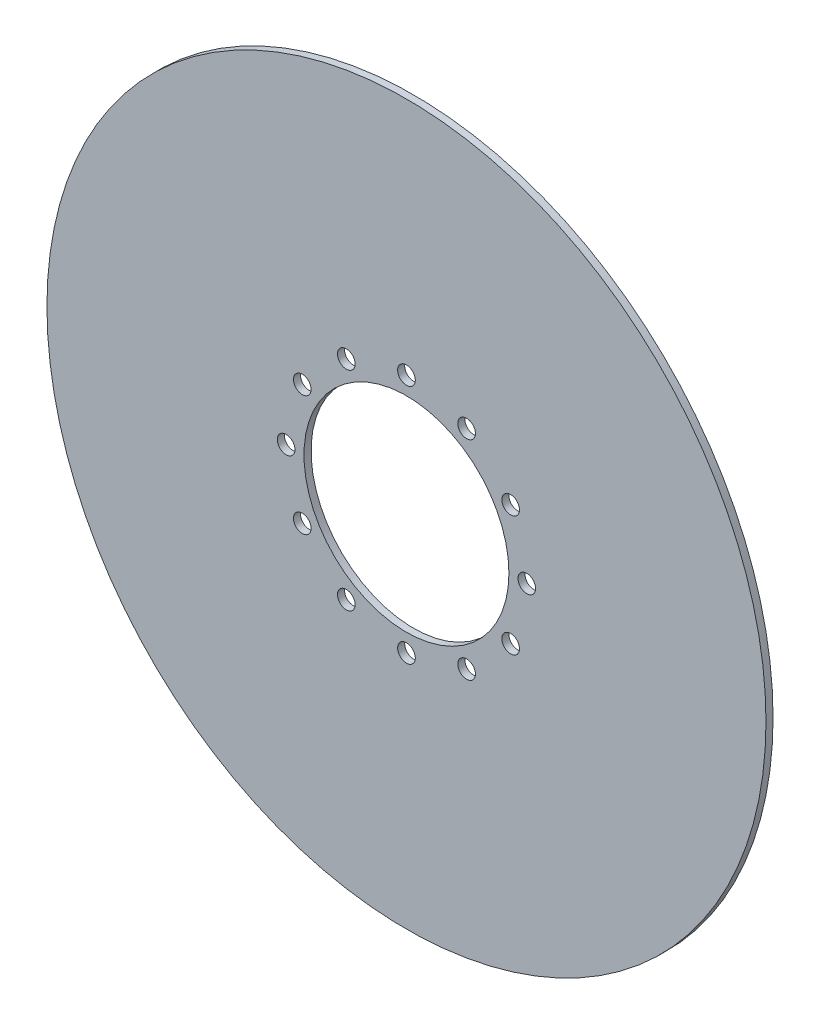
ISO-10303-21;
HEADER;
FILE_DESCRIPTION(('STEP AP214'),'2;1');
FILE_NAME('part.step','',(''),(''),'','','');
FILE_SCHEMA(('AUTOMOTIVE_DESIGN { 1 0 10303 214 1 1 1 1 }'));
ENDSEC;
DATA;
#1=APPLICATION_CONTEXT('core data for automotive mechanical design processes');
#2=APPLICATION_PROTOCOL_DEFINITION('international standard','automotive_design',2000,#1);
#3=PRODUCT_CONTEXT('',#1,'mechanical');
#4=PRODUCT('Part','Part','',(#3));
#5=PRODUCT_RELATED_PRODUCT_CATEGORY('part','',(#4));
#6=PRODUCT_DEFINITION_FORMATION('','',#4);
#7=PRODUCT_DEFINITION_CONTEXT('part definition',#1,'design');
#8=PRODUCT_DEFINITION('design','',#6,#7);
#9=PRODUCT_DEFINITION_SHAPE('','',#8);
#10=(LENGTH_UNIT() NAMED_UNIT(*) SI_UNIT(.MILLI.,.METRE.));
#11=(NAMED_UNIT(*) PLANE_ANGLE_UNIT() SI_UNIT($,.RADIAN.));
#12=(NAMED_UNIT(*) SI_UNIT($,.STERADIAN.) SOLID_ANGLE_UNIT());
#13=UNCERTAINTY_MEASURE_WITH_UNIT(LENGTH_MEASURE(1.E-05),#10,'distance_accuracy_value','');
#14=(GEOMETRIC_REPRESENTATION_CONTEXT(3) GLOBAL_UNCERTAINTY_ASSIGNED_CONTEXT((#13)) GLOBAL_UNIT_ASSIGNED_CONTEXT((#10,
#11,#12)) REPRESENTATION_CONTEXT('',''));
#15=CARTESIAN_POINT('',(0.,0.,0.));
#16=DIRECTION('',(0.,0.,1.));
#17=DIRECTION('',(1.,0.,0.));
#18=AXIS2_PLACEMENT_3D('',#15,#16,#17);
#19=CARTESIAN_POINT('',(0.,0.,2.));
#20=DIRECTION('',(0.,0.,1.));
#21=DIRECTION('',(1.,0.,0.));
#22=AXIS2_PLACEMENT_3D('',#19,#20,#21);
#23=PLANE('',#22);
#24=CARTESIAN_POINT('',(-29.4448637286702,16.9999999999987,2.));
#25=DIRECTION('',(0.,0.,1.));
#26=DIRECTION('',(1.,0.,0.));
#27=AXIS2_PLACEMENT_3D('',#24,#25,#26);
#28=CIRCLE('',#27,2.49698906987796);
#29=CARTESIAN_POINT('',(-26.9478746587923,16.9999999999987,2.));
#30=VERTEX_POINT('',#29);
#31=EDGE_CURVE('E108',#30,#30,#28,.T.);
#32=ORIENTED_EDGE('',*,*,#31,.F.);
#33=EDGE_LOOP('',(#32));
#34=FACE_BOUND('',#33,.T.);
#35=CARTESIAN_POINT('',(-29.4448637286688,-17.0000000000013,2.));
#36=DIRECTION('',(0.,0.,1.));
#37=DIRECTION('',(1.,0.,0.));
#38=AXIS2_PLACEMENT_3D('',#35,#36,#37);
#39=CIRCLE('',#38,2.49698906987796);
#40=CARTESIAN_POINT('',(-26.9478746587908,-17.0000000000013,2.));
#41=VERTEX_POINT('',#40);
#42=EDGE_CURVE('E96',#41,#41,#39,.T.);
#43=ORIENTED_EDGE('',*,*,#42,.F.);
#44=EDGE_LOOP('',(#43));
#45=FACE_BOUND('',#44,.T.);
#46=CARTESIAN_POINT('',(2.86804195578331E-12,-34.,2.));
#47=DIRECTION('',(0.,0.,1.));
#48=DIRECTION('',(1.,0.,0.));
#49=AXIS2_PLACEMENT_3D('',#46,#47,#48);
#50=CIRCLE('',#49,2.49698906987796);
#51=CARTESIAN_POINT('',(2.49698906988083,-34.,2.));
#52=VERTEX_POINT('',#51);
#53=EDGE_CURVE('E84',#52,#52,#50,.T.);
#54=ORIENTED_EDGE('',*,*,#53,.F.);
#55=EDGE_LOOP('',(#54));
#56=FACE_BOUND('',#55,.T.);
#57=CARTESIAN_POINT('',(29.4448637286731,-16.9999999999988,2.));
#58=DIRECTION('',(0.,0.,1.));
#59=DIRECTION('',(1.,0.,0.));
#60=AXIS2_PLACEMENT_3D('',#57,#58,#59);
#61=CIRCLE('',#60,2.49698906987769);
#62=CARTESIAN_POINT('',(31.9418527985508,-16.9999999999988,2.));
#63=VERTEX_POINT('',#62);
#64=EDGE_CURVE('E72',#63,#63,#61,.T.);
#65=ORIENTED_EDGE('',*,*,#64,.F.);
#66=EDGE_LOOP('',(#65));
#67=FACE_BOUND('',#66,.T.);
#68=CARTESIAN_POINT('',(29.4448637286716,17.0000000000012,2.));
#69=DIRECTION('',(0.,0.,1.));
#70=DIRECTION('',(1.,0.,0.));
#71=AXIS2_PLACEMENT_3D('',#68,#69,#70);
#72=CIRCLE('',#71,2.49698906987796);
#73=CARTESIAN_POINT('',(31.9418527985496,17.0000000000012,2.));
#74=VERTEX_POINT('',#73);
#75=EDGE_CURVE('E60',#74,#74,#72,.T.);
#76=ORIENTED_EDGE('',*,*,#75,.F.);
#77=EDGE_LOOP('',(#76));
#78=FACE_BOUND('',#77,.T.);
#79=CARTESIAN_POINT('',(0.,34.,2.));
#80=DIRECTION('',(0.,0.,1.));
#81=DIRECTION('',(1.,0.,0.));
#82=AXIS2_PLACEMENT_3D('',#79,#80,#81);
#83=CIRCLE('',#82,2.49698906987796);
#84=CARTESIAN_POINT('',(2.49698906987796,34.,2.));
#85=VERTEX_POINT('',#84);
#86=EDGE_CURVE('E48',#85,#85,#83,.T.);
#87=ORIENTED_EDGE('',*,*,#86,.F.);
#88=EDGE_LOOP('',(#87));
#89=FACE_BOUND('',#88,.T.);
#90=CARTESIAN_POINT('',(0.,0.,2.));
#91=DIRECTION('',(0.,0.,1.));
#92=DIRECTION('',(1.,0.,0.));
#93=AXIS2_PLACEMENT_3D('',#90,#91,#92);
#94=CIRCLE('',#93,101.6);
#95=CARTESIAN_POINT('',(101.6,0.,2.));
#96=VERTEX_POINT('',#95);
#97=EDGE_CURVE('E10',#96,#96,#94,.T.);
#98=ORIENTED_EDGE('',*,*,#97,.T.);
#99=EDGE_LOOP('',(#98));
#100=FACE_BOUND('',#99,.T.);
#101=CARTESIAN_POINT('',(0.,0.,2.));
#102=DIRECTION('',(0.,0.,1.));
#103=DIRECTION('',(1.,0.,0.));
#104=AXIS2_PLACEMENT_3D('',#101,#102,#103);
#105=CIRCLE('',#104,28.956);
#106=CARTESIAN_POINT('',(28.956,0.,2.));
#107=VERTEX_POINT('',#106);
#108=EDGE_CURVE('E43',#107,#107,#105,.T.);
#109=ORIENTED_EDGE('',*,*,#108,.F.);
#110=EDGE_LOOP('',(#109));
#111=FACE_BOUND('',#110,.T.);
#112=CARTESIAN_POINT('',(17.0000000000002,29.4448637286716,2.));
#113=DIRECTION('',(0.,0.,1.));
#114=DIRECTION('',(1.,0.,0.));
#115=AXIS2_PLACEMENT_3D('',#112,#113,#114);
#116=CIRCLE('',#115,2.49698906987796);
#117=CARTESIAN_POINT('',(19.4969890698782,29.4448637286716,2.));
#118=VERTEX_POINT('',#117);
#119=EDGE_CURVE('E54',#118,#118,#116,.T.);
#120=ORIENTED_EDGE('',*,*,#119,.F.);
#121=EDGE_LOOP('',(#120));
#122=FACE_BOUND('',#121,.T.);
#123=CARTESIAN_POINT('',(34.0000000000014,1.43402097789165E-12,2.));
#124=DIRECTION('',(0.,0.,1.));
#125=DIRECTION('',(1.,0.,0.));
#126=AXIS2_PLACEMENT_3D('',#123,#124,#125);
#127=CIRCLE('',#126,2.49698906987796);
#128=CARTESIAN_POINT('',(36.4969890698794,1.43402097789165E-12,2.));
#129=VERTEX_POINT('',#128);
#130=EDGE_CURVE('E66',#129,#129,#127,.T.);
#131=ORIENTED_EDGE('',*,*,#130,.F.);
#132=EDGE_LOOP('',(#131));
#133=FACE_BOUND('',#132,.T.);
#134=CARTESIAN_POINT('',(17.0000000000027,-29.4448637286702,2.));
#135=DIRECTION('',(0.,0.,1.));
#136=DIRECTION('',(1.,0.,0.));
#137=AXIS2_PLACEMENT_3D('',#134,#135,#136);
#138=CIRCLE('',#137,2.49698906987837);
#139=CARTESIAN_POINT('',(19.4969890698811,-29.4448637286702,2.));
#140=VERTEX_POINT('',#139);
#141=EDGE_CURVE('E78',#140,#140,#138,.T.);
#142=ORIENTED_EDGE('',*,*,#141,.F.);
#143=EDGE_LOOP('',(#142));
#144=FACE_BOUND('',#143,.T.);
#145=CARTESIAN_POINT('',(-16.9999999999973,-29.4448637286716,2.));
#146=DIRECTION('',(0.,0.,1.));
#147=DIRECTION('',(1.,0.,0.));
#148=AXIS2_PLACEMENT_3D('',#145,#146,#147);
#149=CIRCLE('',#148,2.49698906987796);
#150=CARTESIAN_POINT('',(-14.5030109301194,-29.4448637286716,2.));
#151=VERTEX_POINT('',#150);
#152=EDGE_CURVE('E90',#151,#151,#149,.T.);
#153=ORIENTED_EDGE('',*,*,#152,.F.);
#154=EDGE_LOOP('',(#153));
#155=FACE_BOUND('',#154,.T.);
#156=CARTESIAN_POINT('',(-33.9999999999986,-1.43818477700875E-12,2.));
#157=DIRECTION('',(0.,0.,1.));
#158=DIRECTION('',(1.,0.,0.));
#159=AXIS2_PLACEMENT_3D('',#156,#157,#158);
#160=CIRCLE('',#159,2.49698906987796);
#161=CARTESIAN_POINT('',(-31.5030109301206,-1.43818477700875E-12,2.));
#162=VERTEX_POINT('',#161);
#163=EDGE_CURVE('E102',#162,#162,#160,.T.);
#164=ORIENTED_EDGE('',*,*,#163,.F.);
#165=EDGE_LOOP('',(#164));
#166=FACE_BOUND('',#165,.T.);
#167=CARTESIAN_POINT('',(-16.9999999999998,29.4448637286702,2.));
#168=DIRECTION('',(0.,0.,1.));
#169=DIRECTION('',(1.,0.,0.));
#170=AXIS2_PLACEMENT_3D('',#167,#168,#169);
#171=CIRCLE('',#170,2.49698906987796);
#172=CARTESIAN_POINT('',(-14.5030109301219,29.4448637286702,2.));
#173=VERTEX_POINT('',#172);
#174=EDGE_CURVE('E114',#173,#173,#171,.T.);
#175=ORIENTED_EDGE('',*,*,#174,.F.);
#176=EDGE_LOOP('',(#175));
#177=FACE_BOUND('',#176,.T.);
#178=ADVANCED_FACE('F32',(#34,#45,#56,#67,#78,#89,#100,#111,#122,#133,#144,#155,#166,#177),#23,.T.);
#179=CARTESIAN_POINT('',(0.,0.,0.));
#180=DIRECTION('',(0.,0.,1.));
#181=DIRECTION('',(1.,0.,0.));
#182=AXIS2_PLACEMENT_3D('',#179,#180,#181);
#183=PLANE('',#182);
#184=CARTESIAN_POINT('',(0.,0.,0.));
#185=DIRECTION('',(0.,0.,1.));
#186=DIRECTION('',(1.,0.,0.));
#187=AXIS2_PLACEMENT_3D('',#184,#185,#186);
#188=CIRCLE('',#187,101.6);
#189=CARTESIAN_POINT('',(101.6,0.,0.));
#190=VERTEX_POINT('',#189);
#191=EDGE_CURVE('E36',#190,#190,#188,.T.);
#192=ORIENTED_EDGE('',*,*,#191,.F.);
#193=EDGE_LOOP('',(#192));
#194=FACE_BOUND('',#193,.T.);
#195=CARTESIAN_POINT('',(0.,0.,0.));
#196=DIRECTION('',(0.,0.,1.));
#197=DIRECTION('',(1.,0.,0.));
#198=AXIS2_PLACEMENT_3D('',#195,#196,#197);
#199=CIRCLE('',#198,28.956);
#200=CARTESIAN_POINT('',(28.956,0.,0.));
#201=VERTEX_POINT('',#200);
#202=EDGE_CURVE('E45',#201,#201,#199,.T.);
#203=ORIENTED_EDGE('',*,*,#202,.T.);
#204=EDGE_LOOP('',(#203));
#205=FACE_BOUND('',#204,.T.);
#206=CARTESIAN_POINT('',(0.,34.,0.));
#207=DIRECTION('',(0.,0.,1.));
#208=DIRECTION('',(1.,0.,0.));
#209=AXIS2_PLACEMENT_3D('',#206,#207,#208);
#210=CIRCLE('',#209,2.49698906987796);
#211=CARTESIAN_POINT('',(2.49698906987796,34.,0.));
#212=VERTEX_POINT('',#211);
#213=EDGE_CURVE('E51',#212,#212,#210,.T.);
#214=ORIENTED_EDGE('',*,*,#213,.T.);
#215=EDGE_LOOP('',(#214));
#216=FACE_BOUND('',#215,.T.);
#217=CARTESIAN_POINT('',(17.0000000000002,29.4448637286716,0.));
#218=DIRECTION('',(0.,0.,1.));
#219=DIRECTION('',(1.,0.,0.));
#220=AXIS2_PLACEMENT_3D('',#217,#218,#219);
#221=CIRCLE('',#220,2.49698906987796);
#222=CARTESIAN_POINT('',(19.4969890698782,29.4448637286716,0.));
#223=VERTEX_POINT('',#222);
#224=EDGE_CURVE('E57',#223,#223,#221,.T.);
#225=ORIENTED_EDGE('',*,*,#224,.T.);
#226=EDGE_LOOP('',(#225));
#227=FACE_BOUND('',#226,.T.);
#228=CARTESIAN_POINT('',(29.4448637286716,17.0000000000012,0.));
#229=DIRECTION('',(0.,0.,1.));
#230=DIRECTION('',(1.,0.,0.));
#231=AXIS2_PLACEMENT_3D('',#228,#229,#230);
#232=CIRCLE('',#231,2.49698906987796);
#233=CARTESIAN_POINT('',(31.9418527985496,17.0000000000012,0.));
#234=VERTEX_POINT('',#233);
#235=EDGE_CURVE('E63',#234,#234,#232,.T.);
#236=ORIENTED_EDGE('',*,*,#235,.T.);
#237=EDGE_LOOP('',(#236));
#238=FACE_BOUND('',#237,.T.);
#239=CARTESIAN_POINT('',(34.0000000000014,1.43402097789165E-12,0.));
#240=DIRECTION('',(0.,0.,1.));
#241=DIRECTION('',(1.,0.,0.));
#242=AXIS2_PLACEMENT_3D('',#239,#240,#241);
#243=CIRCLE('',#242,2.49698906987796);
#244=CARTESIAN_POINT('',(36.4969890698794,1.43402097789165E-12,0.));
#245=VERTEX_POINT('',#244);
#246=EDGE_CURVE('E69',#245,#245,#243,.T.);
#247=ORIENTED_EDGE('',*,*,#246,.T.);
#248=EDGE_LOOP('',(#247));
#249=FACE_BOUND('',#248,.T.);
#250=CARTESIAN_POINT('',(29.4448637286731,-16.9999999999988,0.));
#251=DIRECTION('',(0.,0.,1.));
#252=DIRECTION('',(1.,0.,0.));
#253=AXIS2_PLACEMENT_3D('',#250,#251,#252);
#254=CIRCLE('',#253,2.49698906987769);
#255=CARTESIAN_POINT('',(31.9418527985508,-16.9999999999988,0.));
#256=VERTEX_POINT('',#255);
#257=EDGE_CURVE('E75',#256,#256,#254,.T.);
#258=ORIENTED_EDGE('',*,*,#257,.T.);
#259=EDGE_LOOP('',(#258));
#260=FACE_BOUND('',#259,.T.);
#261=CARTESIAN_POINT('',(17.0000000000027,-29.4448637286702,0.));
#262=DIRECTION('',(0.,0.,1.));
#263=DIRECTION('',(1.,0.,0.));
#264=AXIS2_PLACEMENT_3D('',#261,#262,#263);
#265=CIRCLE('',#264,2.49698906987837);
#266=CARTESIAN_POINT('',(19.4969890698811,-29.4448637286702,0.));
#267=VERTEX_POINT('',#266);
#268=EDGE_CURVE('E81',#267,#267,#265,.T.);
#269=ORIENTED_EDGE('',*,*,#268,.T.);
#270=EDGE_LOOP('',(#269));
#271=FACE_BOUND('',#270,.T.);
#272=CARTESIAN_POINT('',(2.86804195578331E-12,-34.,0.));
#273=DIRECTION('',(0.,0.,1.));
#274=DIRECTION('',(1.,0.,0.));
#275=AXIS2_PLACEMENT_3D('',#272,#273,#274);
#276=CIRCLE('',#275,2.49698906987796);
#277=CARTESIAN_POINT('',(2.49698906988083,-34.,0.));
#278=VERTEX_POINT('',#277);
#279=EDGE_CURVE('E87',#278,#278,#276,.T.);
#280=ORIENTED_EDGE('',*,*,#279,.T.);
#281=EDGE_LOOP('',(#280));
#282=FACE_BOUND('',#281,.T.);
#283=CARTESIAN_POINT('',(-16.9999999999973,-29.4448637286716,0.));
#284=DIRECTION('',(0.,0.,1.));
#285=DIRECTION('',(1.,0.,0.));
#286=AXIS2_PLACEMENT_3D('',#283,#284,#285);
#287=CIRCLE('',#286,2.49698906987796);
#288=CARTESIAN_POINT('',(-14.5030109301194,-29.4448637286716,0.));
#289=VERTEX_POINT('',#288);
#290=EDGE_CURVE('E93',#289,#289,#287,.T.);
#291=ORIENTED_EDGE('',*,*,#290,.T.);
#292=EDGE_LOOP('',(#291));
#293=FACE_BOUND('',#292,.T.);
#294=CARTESIAN_POINT('',(-29.4448637286688,-17.0000000000013,0.));
#295=DIRECTION('',(0.,0.,1.));
#296=DIRECTION('',(1.,0.,0.));
#297=AXIS2_PLACEMENT_3D('',#294,#295,#296);
#298=CIRCLE('',#297,2.49698906987796);
#299=CARTESIAN_POINT('',(-26.9478746587908,-17.0000000000013,0.));
#300=VERTEX_POINT('',#299);
#301=EDGE_CURVE('E99',#300,#300,#298,.T.);
#302=ORIENTED_EDGE('',*,*,#301,.T.);
#303=EDGE_LOOP('',(#302));
#304=FACE_BOUND('',#303,.T.);
#305=CARTESIAN_POINT('',(-33.9999999999986,-1.43818477700875E-12,0.));
#306=DIRECTION('',(0.,0.,1.));
#307=DIRECTION('',(1.,0.,0.));
#308=AXIS2_PLACEMENT_3D('',#305,#306,#307);
#309=CIRCLE('',#308,2.49698906987796);
#310=CARTESIAN_POINT('',(-31.5030109301206,-1.43818477700875E-12,0.));
#311=VERTEX_POINT('',#310);
#312=EDGE_CURVE('E105',#311,#311,#309,.T.);
#313=ORIENTED_EDGE('',*,*,#312,.T.);
#314=EDGE_LOOP('',(#313));
#315=FACE_BOUND('',#314,.T.);
#316=CARTESIAN_POINT('',(-29.4448637286702,16.9999999999987,0.));
#317=DIRECTION('',(0.,0.,1.));
#318=DIRECTION('',(1.,0.,0.));
#319=AXIS2_PLACEMENT_3D('',#316,#317,#318);
#320=CIRCLE('',#319,2.49698906987796);
#321=CARTESIAN_POINT('',(-26.9478746587923,16.9999999999987,0.));
#322=VERTEX_POINT('',#321);
#323=EDGE_CURVE('E111',#322,#322,#320,.T.);
#324=ORIENTED_EDGE('',*,*,#323,.T.);
#325=EDGE_LOOP('',(#324));
#326=FACE_BOUND('',#325,.T.);
#327=CARTESIAN_POINT('',(-16.9999999999998,29.4448637286702,0.));
#328=DIRECTION('',(0.,0.,1.));
#329=DIRECTION('',(1.,0.,0.));
#330=AXIS2_PLACEMENT_3D('',#327,#328,#329);
#331=CIRCLE('',#330,2.49698906987796);
#332=CARTESIAN_POINT('',(-14.5030109301219,29.4448637286702,0.));
#333=VERTEX_POINT('',#332);
#334=EDGE_CURVE('E117',#333,#333,#331,.T.);
#335=ORIENTED_EDGE('',*,*,#334,.T.);
#336=EDGE_LOOP('',(#335));
#337=FACE_BOUND('',#336,.T.);
#338=ADVANCED_FACE('F127',(#194,#205,#216,#227,#238,#249,#260,#271,#282,#293,#304,#315,#326,
#337),#183,.F.);
#339=CARTESIAN_POINT('',(0.,0.,2.));
#340=DIRECTION('',(0.,0.,-1.));
#341=DIRECTION('',(-1.,0.,0.));
#342=AXIS2_PLACEMENT_3D('',#339,#340,#341);
#343=CYLINDRICAL_SURFACE('',#342,101.6);
#344=ORIENTED_EDGE('',*,*,#97,.F.);
#345=EDGE_LOOP('',(#344));
#346=FACE_BOUND('',#345,.T.);
#347=ORIENTED_EDGE('',*,*,#191,.T.);
#348=EDGE_LOOP('',(#347));
#349=FACE_BOUND('',#348,.T.);
#350=ADVANCED_FACE('F34',(#346,#349),#343,.T.);
#351=CARTESIAN_POINT('',(0.,0.,2.));
#352=DIRECTION('',(0.,0.,-1.));
#353=DIRECTION('',(-1.,0.,0.));
#354=AXIS2_PLACEMENT_3D('',#351,#352,#353);
#355=CYLINDRICAL_SURFACE('',#354,28.956);
#356=ORIENTED_EDGE('',*,*,#108,.T.);
#357=EDGE_LOOP('',(#356));
#358=FACE_BOUND('',#357,.T.);
#359=ORIENTED_EDGE('',*,*,#202,.F.);
#360=EDGE_LOOP('',(#359));
#361=FACE_BOUND('',#360,.T.);
#362=ADVANCED_FACE('F137',(#358,#361),#355,.F.);
#363=CARTESIAN_POINT('',(0.,34.,2.));
#364=DIRECTION('',(0.,0.,-1.));
#365=DIRECTION('',(-1.,0.,0.));
#366=AXIS2_PLACEMENT_3D('',#363,#364,#365);
#367=CYLINDRICAL_SURFACE('',#366,2.49698906987796);
#368=ORIENTED_EDGE('',*,*,#86,.T.);
#369=EDGE_LOOP('',(#368));
#370=FACE_BOUND('',#369,.T.);
#371=ORIENTED_EDGE('',*,*,#213,.F.);
#372=EDGE_LOOP('',(#371));
#373=FACE_BOUND('',#372,.T.);
#374=ADVANCED_FACE('F140',(#370,#373),#367,.F.);
#375=CARTESIAN_POINT('',(17.0000000000002,29.4448637286716,2.));
#376=DIRECTION('',(0.,0.,-1.));
#377=DIRECTION('',(-1.,0.,0.));
#378=AXIS2_PLACEMENT_3D('',#375,#376,#377);
#379=CYLINDRICAL_SURFACE('',#378,2.49698906987796);
#380=ORIENTED_EDGE('',*,*,#119,.T.);
#381=EDGE_LOOP('',(#380));
#382=FACE_BOUND('',#381,.T.);
#383=ORIENTED_EDGE('',*,*,#224,.F.);
#384=EDGE_LOOP('',(#383));
#385=FACE_BOUND('',#384,.T.);
#386=ADVANCED_FACE('F144',(#382,#385),#379,.F.);
#387=CARTESIAN_POINT('',(29.4448637286716,17.0000000000012,2.));
#388=DIRECTION('',(0.,0.,-1.));
#389=DIRECTION('',(-1.,0.,0.));
#390=AXIS2_PLACEMENT_3D('',#387,#388,#389);
#391=CYLINDRICAL_SURFACE('',#390,2.49698906987796);
#392=ORIENTED_EDGE('',*,*,#75,.T.);
#393=EDGE_LOOP('',(#392));
#394=FACE_BOUND('',#393,.T.);
#395=ORIENTED_EDGE('',*,*,#235,.F.);
#396=EDGE_LOOP('',(#395));
#397=FACE_BOUND('',#396,.T.);
#398=ADVANCED_FACE('F148',(#394,#397),#391,.F.);
#399=CARTESIAN_POINT('',(34.0000000000014,1.43402097789165E-12,2.));
#400=DIRECTION('',(0.,0.,-1.));
#401=DIRECTION('',(-1.,0.,0.));
#402=AXIS2_PLACEMENT_3D('',#399,#400,#401);
#403=CYLINDRICAL_SURFACE('',#402,2.49698906987796);
#404=ORIENTED_EDGE('',*,*,#130,.T.);
#405=EDGE_LOOP('',(#404));
#406=FACE_BOUND('',#405,.T.);
#407=ORIENTED_EDGE('',*,*,#246,.F.);
#408=EDGE_LOOP('',(#407));
#409=FACE_BOUND('',#408,.T.);
#410=ADVANCED_FACE('F152',(#406,#409),#403,.F.);
#411=CARTESIAN_POINT('',(29.4448637286731,-16.9999999999988,2.));
#412=DIRECTION('',(0.,0.,-1.));
#413=DIRECTION('',(-1.,0.,0.));
#414=AXIS2_PLACEMENT_3D('',#411,#412,#413);
#415=CYLINDRICAL_SURFACE('',#414,2.49698906987769);
#416=ORIENTED_EDGE('',*,*,#64,.T.);
#417=EDGE_LOOP('',(#416));
#418=FACE_BOUND('',#417,.T.);
#419=ORIENTED_EDGE('',*,*,#257,.F.);
#420=EDGE_LOOP('',(#419));
#421=FACE_BOUND('',#420,.T.);
#422=ADVANCED_FACE('F156',(#418,#421),#415,.F.);
#423=CARTESIAN_POINT('',(17.0000000000027,-29.4448637286702,2.));
#424=DIRECTION('',(0.,0.,-1.));
#425=DIRECTION('',(-1.,0.,0.));
#426=AXIS2_PLACEMENT_3D('',#423,#424,#425);
#427=CYLINDRICAL_SURFACE('',#426,2.49698906987837);
#428=ORIENTED_EDGE('',*,*,#141,.T.);
#429=EDGE_LOOP('',(#428));
#430=FACE_BOUND('',#429,.T.);
#431=ORIENTED_EDGE('',*,*,#268,.F.);
#432=EDGE_LOOP('',(#431));
#433=FACE_BOUND('',#432,.T.);
#434=ADVANCED_FACE('F160',(#430,#433),#427,.F.);
#435=CARTESIAN_POINT('',(2.86804195578331E-12,-34.,2.));
#436=DIRECTION('',(0.,0.,-1.));
#437=DIRECTION('',(-1.,0.,0.));
#438=AXIS2_PLACEMENT_3D('',#435,#436,#437);
#439=CYLINDRICAL_SURFACE('',#438,2.49698906987796);
#440=ORIENTED_EDGE('',*,*,#53,.T.);
#441=EDGE_LOOP('',(#440));
#442=FACE_BOUND('',#441,.T.);
#443=ORIENTED_EDGE('',*,*,#279,.F.);
#444=EDGE_LOOP('',(#443));
#445=FACE_BOUND('',#444,.T.);
#446=ADVANCED_FACE('F164',(#442,#445),#439,.F.);
#447=CARTESIAN_POINT('',(-16.9999999999973,-29.4448637286716,2.));
#448=DIRECTION('',(0.,0.,-1.));
#449=DIRECTION('',(-1.,0.,0.));
#450=AXIS2_PLACEMENT_3D('',#447,#448,#449);
#451=CYLINDRICAL_SURFACE('',#450,2.49698906987796);
#452=ORIENTED_EDGE('',*,*,#152,.T.);
#453=EDGE_LOOP('',(#452));
#454=FACE_BOUND('',#453,.T.);
#455=ORIENTED_EDGE('',*,*,#290,.F.);
#456=EDGE_LOOP('',(#455));
#457=FACE_BOUND('',#456,.T.);
#458=ADVANCED_FACE('F168',(#454,#457),#451,.F.);
#459=CARTESIAN_POINT('',(-29.4448637286688,-17.0000000000013,2.));
#460=DIRECTION('',(0.,0.,-1.));
#461=DIRECTION('',(-1.,0.,0.));
#462=AXIS2_PLACEMENT_3D('',#459,#460,#461);
#463=CYLINDRICAL_SURFACE('',#462,2.49698906987796);
#464=ORIENTED_EDGE('',*,*,#42,.T.);
#465=EDGE_LOOP('',(#464));
#466=FACE_BOUND('',#465,.T.);
#467=ORIENTED_EDGE('',*,*,#301,.F.);
#468=EDGE_LOOP('',(#467));
#469=FACE_BOUND('',#468,.T.);
#470=ADVANCED_FACE('F172',(#466,#469),#463,.F.);
#471=CARTESIAN_POINT('',(-33.9999999999986,-1.43818477700875E-12,2.));
#472=DIRECTION('',(0.,0.,-1.));
#473=DIRECTION('',(-1.,0.,0.));
#474=AXIS2_PLACEMENT_3D('',#471,#472,#473);
#475=CYLINDRICAL_SURFACE('',#474,2.49698906987796);
#476=ORIENTED_EDGE('',*,*,#163,.T.);
#477=EDGE_LOOP('',(#476));
#478=FACE_BOUND('',#477,.T.);
#479=ORIENTED_EDGE('',*,*,#312,.F.);
#480=EDGE_LOOP('',(#479));
#481=FACE_BOUND('',#480,.T.);
#482=ADVANCED_FACE('F176',(#478,#481),#475,.F.);
#483=CARTESIAN_POINT('',(-29.4448637286702,16.9999999999987,2.));
#484=DIRECTION('',(0.,0.,-1.));
#485=DIRECTION('',(-1.,0.,0.));
#486=AXIS2_PLACEMENT_3D('',#483,#484,#485);
#487=CYLINDRICAL_SURFACE('',#486,2.49698906987796);
#488=ORIENTED_EDGE('',*,*,#31,.T.);
#489=EDGE_LOOP('',(#488));
#490=FACE_BOUND('',#489,.T.);
#491=ORIENTED_EDGE('',*,*,#323,.F.);
#492=EDGE_LOOP('',(#491));
#493=FACE_BOUND('',#492,.T.);
#494=ADVANCED_FACE('F180',(#490,#493),#487,.F.);
#495=CARTESIAN_POINT('',(-16.9999999999998,29.4448637286702,2.));
#496=DIRECTION('',(0.,0.,-1.));
#497=DIRECTION('',(-1.,0.,0.));
#498=AXIS2_PLACEMENT_3D('',#495,#496,#497);
#499=CYLINDRICAL_SURFACE('',#498,2.49698906987796);
#500=ORIENTED_EDGE('',*,*,#174,.T.);
#501=EDGE_LOOP('',(#500));
#502=FACE_BOUND('',#501,.T.);
#503=ORIENTED_EDGE('',*,*,#334,.F.);
#504=EDGE_LOOP('',(#503));
#505=FACE_BOUND('',#504,.T.);
#506=ADVANCED_FACE('F123',(#502,#505),#499,.F.);
#507=CLOSED_SHELL('',(#178,#338,#350,#362,#374,#386,#398,#410,#422,#434,#446,#458,#470,#482,
#494,#506));
#508=MANIFOLD_SOLID_BREP('B2',#507);
#509=ADVANCED_BREP_SHAPE_REPRESENTATION('',(#18,#508),#14);
#510=SHAPE_DEFINITION_REPRESENTATION(#9,#509);
ENDSEC;
END-ISO-10303-21;
